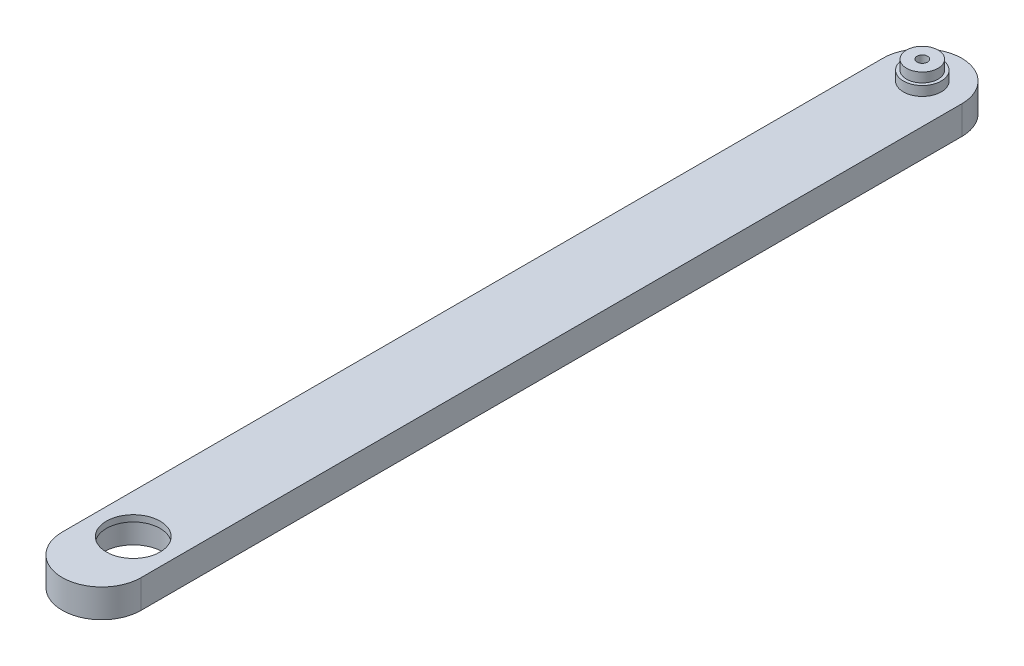
ISO-10303-21;
HEADER;
FILE_DESCRIPTION(('STEP AP214'),'2;1');
FILE_NAME('part.step','',(''),(''),'','','');
FILE_SCHEMA(('AUTOMOTIVE_DESIGN { 1 0 10303 214 1 1 1 1 }'));
ENDSEC;
DATA;
#1=APPLICATION_CONTEXT('core data for automotive mechanical design processes');
#2=APPLICATION_PROTOCOL_DEFINITION('international standard','automotive_design',2000,#1);
#3=PRODUCT_CONTEXT('',#1,'mechanical');
#4=PRODUCT('Part','Part','',(#3));
#5=PRODUCT_RELATED_PRODUCT_CATEGORY('part','',(#4));
#6=PRODUCT_DEFINITION_FORMATION('','',#4);
#7=PRODUCT_DEFINITION_CONTEXT('part definition',#1,'design');
#8=PRODUCT_DEFINITION('design','',#6,#7);
#9=PRODUCT_DEFINITION_SHAPE('','',#8);
#10=(LENGTH_UNIT() NAMED_UNIT(*) SI_UNIT(.MILLI.,.METRE.));
#11=(NAMED_UNIT(*) PLANE_ANGLE_UNIT() SI_UNIT($,.RADIAN.));
#12=(NAMED_UNIT(*) SI_UNIT($,.STERADIAN.) SOLID_ANGLE_UNIT());
#13=UNCERTAINTY_MEASURE_WITH_UNIT(LENGTH_MEASURE(1.E-05),#10,'distance_accuracy_value','');
#14=(GEOMETRIC_REPRESENTATION_CONTEXT(3) GLOBAL_UNCERTAINTY_ASSIGNED_CONTEXT((#13)) GLOBAL_UNIT_ASSIGNED_CONTEXT((#10,
#11,#12)) REPRESENTATION_CONTEXT('',''));
#15=CARTESIAN_POINT('',(0.,0.,0.));
#16=DIRECTION('',(0.,0.,1.));
#17=DIRECTION('',(1.,0.,0.));
#18=AXIS2_PLACEMENT_3D('',#15,#16,#17);
#19=CARTESIAN_POINT('',(0.,-4.5,0.));
#20=DIRECTION('',(0.,1.,0.));
#21=DIRECTION('',(0.,0.,1.));
#22=AXIS2_PLACEMENT_3D('',#19,#20,#21);
#23=CYLINDRICAL_SURFACE('',#22,12.5);
#24=DIRECTION('',(0.,1.,0.));
#25=VECTOR('',#24,1.);
#26=CARTESIAN_POINT('',(-12.5,-4.5,0.));
#27=LINE('',#26,#25);
#28=CARTESIAN_POINT('',(-12.5,-4.5,0.));
#29=VERTEX_POINT('',#28);
#30=CARTESIAN_POINT('',(-12.5,4.5,0.));
#31=VERTEX_POINT('',#30);
#32=EDGE_CURVE('E77',#29,#31,#27,.T.);
#33=ORIENTED_EDGE('',*,*,#32,.T.);
#34=CARTESIAN_POINT('',(0.,4.5,0.));
#35=DIRECTION('',(0.,1.,0.));
#36=DIRECTION('',(0.,0.,1.));
#37=AXIS2_PLACEMENT_3D('',#34,#35,#36);
#38=CIRCLE('',#37,12.5);
#39=CARTESIAN_POINT('',(12.5,4.5,0.));
#40=VERTEX_POINT('',#39);
#41=EDGE_CURVE('E80',#40,#31,#38,.T.);
#42=ORIENTED_EDGE('',*,*,#41,.F.);
#43=DIRECTION('',(0.,1.,0.));
#44=VECTOR('',#43,1.);
#45=CARTESIAN_POINT('',(12.5,-4.5,0.));
#46=LINE('',#45,#44);
#47=CARTESIAN_POINT('',(12.5,-4.5,0.));
#48=VERTEX_POINT('',#47);
#49=EDGE_CURVE('E52',#48,#40,#46,.T.);
#50=ORIENTED_EDGE('',*,*,#49,.F.);
#51=CARTESIAN_POINT('',(0.,-4.5,0.));
#52=DIRECTION('',(0.,1.,0.));
#53=DIRECTION('',(0.,0.,1.));
#54=AXIS2_PLACEMENT_3D('',#51,#52,#53);
#55=CIRCLE('',#54,12.5);
#56=EDGE_CURVE('E81',#48,#29,#55,.T.);
#57=ORIENTED_EDGE('',*,*,#56,.T.);
#58=EDGE_LOOP('',(#33,#42,#50,#57));
#59=FACE_BOUND('',#58,.T.);
#60=ADVANCED_FACE('F36',(#59),#23,.T.);
#61=CARTESIAN_POINT('',(12.5,-4.5,0.));
#62=DIRECTION('',(1.,0.,0.));
#63=DIRECTION('',(0.,0.,-1.));
#64=AXIS2_PLACEMENT_3D('',#61,#62,#63);
#65=PLANE('',#64);
#66=ORIENTED_EDGE('',*,*,#49,.T.);
#67=DIRECTION('',(0.,0.,-1.));
#68=VECTOR('',#67,1.);
#69=CARTESIAN_POINT('',(12.5,4.5,0.));
#70=LINE('',#69,#68);
#71=CARTESIAN_POINT('',(12.5,4.5,260.));
#72=VERTEX_POINT('',#71);
#73=EDGE_CURVE('E98',#72,#40,#70,.T.);
#74=ORIENTED_EDGE('',*,*,#73,.F.);
#75=DIRECTION('',(0.,1.,0.));
#76=VECTOR('',#75,1.);
#77=CARTESIAN_POINT('',(12.5,-4.5,260.));
#78=LINE('',#77,#76);
#79=CARTESIAN_POINT('',(12.5,-4.5,260.));
#80=VERTEX_POINT('',#79);
#81=EDGE_CURVE('E60',#80,#72,#78,.T.);
#82=ORIENTED_EDGE('',*,*,#81,.F.);
#83=DIRECTION('',(0.,0.,-1.));
#84=VECTOR('',#83,1.);
#85=CARTESIAN_POINT('',(12.5,-4.5,0.));
#86=LINE('',#85,#84);
#87=EDGE_CURVE('E86',#80,#48,#86,.T.);
#88=ORIENTED_EDGE('',*,*,#87,.T.);
#89=EDGE_LOOP('',(#66,#74,#82,#88));
#90=FACE_BOUND('',#89,.T.);
#91=ADVANCED_FACE('F149',(#90),#65,.T.);
#92=CARTESIAN_POINT('',(0.,-4.5,260.));
#93=DIRECTION('',(0.,1.,0.));
#94=DIRECTION('',(0.,0.,1.));
#95=AXIS2_PLACEMENT_3D('',#92,#93,#94);
#96=CYLINDRICAL_SURFACE('',#95,12.5);
#97=ORIENTED_EDGE('',*,*,#81,.T.);
#98=CARTESIAN_POINT('',(0.,4.5,260.));
#99=DIRECTION('',(0.,1.,0.));
#100=DIRECTION('',(0.,0.,1.));
#101=AXIS2_PLACEMENT_3D('',#98,#99,#100);
#102=CIRCLE('',#101,12.5);
#103=CARTESIAN_POINT('',(-12.4999999999999,4.5,260.));
#104=VERTEX_POINT('',#103);
#105=EDGE_CURVE('E94',#104,#72,#102,.T.);
#106=ORIENTED_EDGE('',*,*,#105,.F.);
#107=DIRECTION('',(0.,1.,0.));
#108=VECTOR('',#107,1.);
#109=CARTESIAN_POINT('',(-12.4999999999999,-4.5,260.));
#110=LINE('',#109,#108);
#111=CARTESIAN_POINT('',(-12.4999999999999,-4.5,260.));
#112=VERTEX_POINT('',#111);
#113=EDGE_CURVE('E85',#112,#104,#110,.T.);
#114=ORIENTED_EDGE('',*,*,#113,.F.);
#115=CARTESIAN_POINT('',(0.,-4.5,260.));
#116=DIRECTION('',(0.,1.,0.));
#117=DIRECTION('',(0.,0.,1.));
#118=AXIS2_PLACEMENT_3D('',#115,#116,#117);
#119=CIRCLE('',#118,12.5);
#120=EDGE_CURVE('E111',#112,#80,#119,.T.);
#121=ORIENTED_EDGE('',*,*,#120,.T.);
#122=EDGE_LOOP('',(#97,#106,#114,#121));
#123=FACE_BOUND('',#122,.T.);
#124=ADVANCED_FACE('F154',(#123),#96,.T.);
#125=CARTESIAN_POINT('',(-12.5,-4.5,0.));
#126=DIRECTION('',(-1.,0.,0.));
#127=DIRECTION('',(0.,0.,1.));
#128=AXIS2_PLACEMENT_3D('',#125,#126,#127);
#129=PLANE('',#128);
#130=ORIENTED_EDGE('',*,*,#113,.T.);
#131=DIRECTION('',(0.,0.,1.));
#132=VECTOR('',#131,1.);
#133=CARTESIAN_POINT('',(-12.5,4.5,0.));
#134=LINE('',#133,#132);
#135=EDGE_CURVE('E89',#31,#104,#134,.T.);
#136=ORIENTED_EDGE('',*,*,#135,.F.);
#137=ORIENTED_EDGE('',*,*,#32,.F.);
#138=DIRECTION('',(0.,0.,1.));
#139=VECTOR('',#138,1.);
#140=CARTESIAN_POINT('',(-12.5,-4.5,0.));
#141=LINE('',#140,#139);
#142=EDGE_CURVE('E109',#29,#112,#141,.T.);
#143=ORIENTED_EDGE('',*,*,#142,.T.);
#144=EDGE_LOOP('',(#130,#136,#137,#143));
#145=FACE_BOUND('',#144,.T.);
#146=ADVANCED_FACE('F90',(#145),#129,.T.);
#147=CARTESIAN_POINT('',(0.,-4.5,0.));
#148=DIRECTION('',(0.,1.,0.));
#149=DIRECTION('',(0.,0.,1.));
#150=AXIS2_PLACEMENT_3D('',#147,#148,#149);
#151=PLANE('',#150);
#152=CARTESIAN_POINT('',(0.,-4.5,250.));
#153=DIRECTION('',(0.,-1.,0.));
#154=DIRECTION('',(0.,0.,-1.));
#155=AXIS2_PLACEMENT_3D('',#152,#153,#154);
#156=CIRCLE('',#155,9.50000000000001);
#157=CARTESIAN_POINT('',(0.,-4.5,240.5));
#158=VERTEX_POINT('',#157);
#159=EDGE_CURVE('E189',#158,#158,#156,.T.);
#160=ORIENTED_EDGE('',*,*,#159,.F.);
#161=EDGE_LOOP('',(#160));
#162=FACE_BOUND('',#161,.T.);
#163=CARTESIAN_POINT('',(0.,-4.5,0.));
#164=DIRECTION('',(0.,1.,0.));
#165=DIRECTION('',(0.,0.,1.));
#166=AXIS2_PLACEMENT_3D('',#163,#164,#165);
#167=CIRCLE('',#166,6.);
#168=CARTESIAN_POINT('',(0.,-4.5,6.));
#169=VERTEX_POINT('',#168);
#170=EDGE_CURVE('E123',#169,#169,#167,.F.);
#171=ORIENTED_EDGE('',*,*,#170,.F.);
#172=EDGE_LOOP('',(#171));
#173=FACE_BOUND('',#172,.T.);
#174=ORIENTED_EDGE('',*,*,#56,.F.);
#175=ORIENTED_EDGE('',*,*,#87,.F.);
#176=ORIENTED_EDGE('',*,*,#120,.F.);
#177=ORIENTED_EDGE('',*,*,#142,.F.);
#178=EDGE_LOOP('',(#174,#175,#176,#177));
#179=FACE_BOUND('',#178,.T.);
#180=ADVANCED_FACE('F198',(#162,#173,#179),#151,.F.);
#181=CARTESIAN_POINT('',(0.,4.5,0.));
#182=DIRECTION('',(0.,1.,0.));
#183=DIRECTION('',(0.,0.,1.));
#184=AXIS2_PLACEMENT_3D('',#181,#182,#183);
#185=PLANE('',#184);
#186=CARTESIAN_POINT('',(0.,4.5,250.));
#187=DIRECTION('',(0.,1.,0.));
#188=DIRECTION('',(0.,0.,1.));
#189=AXIS2_PLACEMENT_3D('',#186,#187,#188);
#190=CIRCLE('',#189,8.50000000000001);
#191=CARTESIAN_POINT('',(0.,4.5,258.5));
#192=VERTEX_POINT('',#191);
#193=EDGE_CURVE('E40',#192,#192,#190,.T.);
#194=ORIENTED_EDGE('',*,*,#193,.F.);
#195=EDGE_LOOP('',(#194));
#196=FACE_BOUND('',#195,.T.);
#197=CARTESIAN_POINT('',(0.,4.5,0.));
#198=DIRECTION('',(0.,1.,0.));
#199=DIRECTION('',(0.,0.,1.));
#200=AXIS2_PLACEMENT_3D('',#197,#198,#199);
#201=CIRCLE('',#200,6.);
#202=CARTESIAN_POINT('',(0.,4.5,6.));
#203=VERTEX_POINT('',#202);
#204=EDGE_CURVE('E188',#203,#203,#201,.T.);
#205=ORIENTED_EDGE('',*,*,#204,.F.);
#206=EDGE_LOOP('',(#205));
#207=FACE_BOUND('',#206,.T.);
#208=ORIENTED_EDGE('',*,*,#41,.T.);
#209=ORIENTED_EDGE('',*,*,#135,.T.);
#210=ORIENTED_EDGE('',*,*,#105,.T.);
#211=ORIENTED_EDGE('',*,*,#73,.T.);
#212=EDGE_LOOP('',(#208,#209,#210,#211));
#213=FACE_BOUND('',#212,.T.);
#214=ADVANCED_FACE('F97',(#196,#207,#213),#185,.T.);
#215=CARTESIAN_POINT('',(0.,-7.5,0.));
#216=DIRECTION('',(0.,1.,0.));
#217=DIRECTION('',(0.,0.,1.));
#218=AXIS2_PLACEMENT_3D('',#215,#216,#217);
#219=CYLINDRICAL_SURFACE('',#218,6.);
#220=CARTESIAN_POINT('',(0.,-7.5,0.));
#221=DIRECTION('',(0.,-1.,0.));
#222=DIRECTION('',(0.,0.,-1.));
#223=AXIS2_PLACEMENT_3D('',#220,#221,#222);
#224=CIRCLE('',#223,6.);
#225=CARTESIAN_POINT('',(0.,-7.5,-6.));
#226=VERTEX_POINT('',#225);
#227=EDGE_CURVE('E99',#226,#226,#224,.T.);
#228=ORIENTED_EDGE('',*,*,#227,.F.);
#229=EDGE_LOOP('',(#228));
#230=FACE_BOUND('',#229,.T.);
#231=ORIENTED_EDGE('',*,*,#170,.T.);
#232=EDGE_LOOP('',(#231));
#233=FACE_BOUND('',#232,.T.);
#234=ADVANCED_FACE('F144',(#230,#233),#219,.T.);
#235=CARTESIAN_POINT('',(0.,-7.5,0.));
#236=DIRECTION('',(0.,-1.,0.));
#237=DIRECTION('',(0.,0.,-1.));
#238=AXIS2_PLACEMENT_3D('',#235,#236,#237);
#239=PLANE('',#238);
#240=CARTESIAN_POINT('',(0.,-7.5,0.));
#241=DIRECTION('',(0.,-1.,0.));
#242=DIRECTION('',(0.,0.,-1.));
#243=AXIS2_PLACEMENT_3D('',#240,#241,#242);
#244=CIRCLE('',#243,5.);
#245=CARTESIAN_POINT('',(0.,-7.5,-5.));
#246=VERTEX_POINT('',#245);
#247=EDGE_CURVE('E45',#246,#246,#244,.F.);
#248=ORIENTED_EDGE('',*,*,#247,.T.);
#249=EDGE_LOOP('',(#248));
#250=FACE_BOUND('',#249,.T.);
#251=ORIENTED_EDGE('',*,*,#227,.T.);
#252=EDGE_LOOP('',(#251));
#253=FACE_BOUND('',#252,.T.);
#254=ADVANCED_FACE('F129',(#250,#253),#239,.T.);
#255=CARTESIAN_POINT('',(0.,-10.5,0.));
#256=DIRECTION('',(0.,1.,0.));
#257=DIRECTION('',(0.,0.,1.));
#258=AXIS2_PLACEMENT_3D('',#255,#256,#257);
#259=PLANE('',#258);
#260=CARTESIAN_POINT('',(0.,-10.5,0.));
#261=DIRECTION('',(0.,-1.,0.));
#262=DIRECTION('',(0.,0.,-1.));
#263=AXIS2_PLACEMENT_3D('',#260,#261,#262);
#264=CIRCLE('',#263,1.65);
#265=CARTESIAN_POINT('',(0.,-10.5,-1.65));
#266=VERTEX_POINT('',#265);
#267=EDGE_CURVE('E178',#266,#266,#264,.T.);
#268=ORIENTED_EDGE('',*,*,#267,.F.);
#269=EDGE_LOOP('',(#268));
#270=FACE_BOUND('',#269,.T.);
#271=CARTESIAN_POINT('',(0.,-10.5,0.));
#272=DIRECTION('',(0.,1.,0.));
#273=DIRECTION('',(0.,0.,1.));
#274=AXIS2_PLACEMENT_3D('',#271,#272,#273);
#275=CIRCLE('',#274,5.);
#276=CARTESIAN_POINT('',(0.,-10.5,5.));
#277=VERTEX_POINT('',#276);
#278=EDGE_CURVE('E120',#277,#277,#275,.T.);
#279=ORIENTED_EDGE('',*,*,#278,.F.);
#280=EDGE_LOOP('',(#279));
#281=FACE_BOUND('',#280,.T.);
#282=ADVANCED_FACE('F136',(#270,#281),#259,.F.);
#283=CARTESIAN_POINT('',(0.,-10.5,0.));
#284=DIRECTION('',(0.,1.,0.));
#285=DIRECTION('',(0.,0.,1.));
#286=AXIS2_PLACEMENT_3D('',#283,#284,#285);
#287=CYLINDRICAL_SURFACE('',#286,5.);
#288=ORIENTED_EDGE('',*,*,#247,.F.);
#289=EDGE_LOOP('',(#288));
#290=FACE_BOUND('',#289,.T.);
#291=ORIENTED_EDGE('',*,*,#278,.T.);
#292=EDGE_LOOP('',(#291));
#293=FACE_BOUND('',#292,.T.);
#294=ADVANCED_FACE('F132',(#290,#293),#287,.T.);
#295=CARTESIAN_POINT('',(0.,7.5,0.));
#296=DIRECTION('',(0.,-1.,0.));
#297=DIRECTION('',(0.,0.,-1.));
#298=AXIS2_PLACEMENT_3D('',#295,#296,#297);
#299=CYLINDRICAL_SURFACE('',#298,6.);
#300=CARTESIAN_POINT('',(0.,7.5,0.));
#301=DIRECTION('',(0.,1.,0.));
#302=DIRECTION('',(0.,0.,1.));
#303=AXIS2_PLACEMENT_3D('',#300,#301,#302);
#304=CIRCLE('',#303,6.);
#305=CARTESIAN_POINT('',(0.,7.5,6.));
#306=VERTEX_POINT('',#305);
#307=EDGE_CURVE('E102',#306,#306,#304,.T.);
#308=ORIENTED_EDGE('',*,*,#307,.F.);
#309=EDGE_LOOP('',(#308));
#310=FACE_BOUND('',#309,.T.);
#311=ORIENTED_EDGE('',*,*,#204,.T.);
#312=EDGE_LOOP('',(#311));
#313=FACE_BOUND('',#312,.T.);
#314=ADVANCED_FACE('F135',(#310,#313),#299,.T.);
#315=CARTESIAN_POINT('',(0.,7.5,0.));
#316=DIRECTION('',(0.,1.,0.));
#317=DIRECTION('',(0.,0.,1.));
#318=AXIS2_PLACEMENT_3D('',#315,#316,#317);
#319=PLANE('',#318);
#320=CARTESIAN_POINT('',(0.,7.5,0.));
#321=DIRECTION('',(0.,1.,0.));
#322=DIRECTION('',(0.,0.,1.));
#323=AXIS2_PLACEMENT_3D('',#320,#321,#322);
#324=CIRCLE('',#323,5.);
#325=CARTESIAN_POINT('',(0.,7.5,5.));
#326=VERTEX_POINT('',#325);
#327=EDGE_CURVE('E11',#326,#326,#324,.F.);
#328=ORIENTED_EDGE('',*,*,#327,.T.);
#329=EDGE_LOOP('',(#328));
#330=FACE_BOUND('',#329,.T.);
#331=ORIENTED_EDGE('',*,*,#307,.T.);
#332=EDGE_LOOP('',(#331));
#333=FACE_BOUND('',#332,.T.);
#334=ADVANCED_FACE('F160',(#330,#333),#319,.T.);
#335=CARTESIAN_POINT('',(0.,10.5,0.));
#336=DIRECTION('',(0.,1.,0.));
#337=DIRECTION('',(0.,0.,1.));
#338=AXIS2_PLACEMENT_3D('',#335,#336,#337);
#339=PLANE('',#338);
#340=CARTESIAN_POINT('',(0.,10.5,0.));
#341=DIRECTION('',(0.,-1.,0.));
#342=DIRECTION('',(0.,0.,-1.));
#343=AXIS2_PLACEMENT_3D('',#340,#341,#342);
#344=CIRCLE('',#343,1.64999999999999);
#345=CARTESIAN_POINT('',(0.,10.5,-1.64999999999999));
#346=VERTEX_POINT('',#345);
#347=EDGE_CURVE('E173',#346,#346,#344,.T.);
#348=ORIENTED_EDGE('',*,*,#347,.T.);
#349=EDGE_LOOP('',(#348));
#350=FACE_BOUND('',#349,.T.);
#351=CARTESIAN_POINT('',(0.,10.5,0.));
#352=DIRECTION('',(0.,1.,0.));
#353=DIRECTION('',(0.,0.,1.));
#354=AXIS2_PLACEMENT_3D('',#351,#352,#353);
#355=CIRCLE('',#354,5.);
#356=CARTESIAN_POINT('',(0.,10.5,5.));
#357=VERTEX_POINT('',#356);
#358=EDGE_CURVE('E115',#357,#357,#355,.T.);
#359=ORIENTED_EDGE('',*,*,#358,.T.);
#360=EDGE_LOOP('',(#359));
#361=FACE_BOUND('',#360,.T.);
#362=ADVANCED_FACE('F158',(#350,#361),#339,.T.);
#363=ORIENTED_EDGE('',*,*,#327,.F.);
#364=EDGE_LOOP('',(#363));
#365=FACE_BOUND('',#364,.T.);
#366=ORIENTED_EDGE('',*,*,#358,.F.);
#367=EDGE_LOOP('',(#366));
#368=FACE_BOUND('',#367,.T.);
#369=ADVANCED_FACE('F38',(#365,#368),#287,.T.);
#370=CARTESIAN_POINT('',(0.,2.5,250.));
#371=DIRECTION('',(0.,-1.,0.));
#372=DIRECTION('',(0.,0.,-1.));
#373=AXIS2_PLACEMENT_3D('',#370,#371,#372);
#374=CYLINDRICAL_SURFACE('',#373,9.50000000000001);
#375=CARTESIAN_POINT('',(0.,2.5,250.));
#376=DIRECTION('',(0.,-1.,0.));
#377=DIRECTION('',(0.,0.,-1.));
#378=AXIS2_PLACEMENT_3D('',#375,#376,#377);
#379=CIRCLE('',#378,9.50000000000001);
#380=CARTESIAN_POINT('',(0.,2.5,240.5));
#381=VERTEX_POINT('',#380);
#382=EDGE_CURVE('E185',#381,#381,#379,.T.);
#383=ORIENTED_EDGE('',*,*,#382,.F.);
#384=EDGE_LOOP('',(#383));
#385=FACE_BOUND('',#384,.T.);
#386=ORIENTED_EDGE('',*,*,#159,.T.);
#387=EDGE_LOOP('',(#386));
#388=FACE_BOUND('',#387,.T.);
#389=ADVANCED_FACE('F166',(#385,#388),#374,.F.);
#390=CARTESIAN_POINT('',(0.,2.5,250.));
#391=DIRECTION('',(0.,-1.,0.));
#392=DIRECTION('',(0.,0.,-1.));
#393=AXIS2_PLACEMENT_3D('',#390,#391,#392);
#394=PLANE('',#393);
#395=CARTESIAN_POINT('',(0.,2.5,250.));
#396=DIRECTION('',(0.,-1.,0.));
#397=DIRECTION('',(0.,0.,-1.));
#398=AXIS2_PLACEMENT_3D('',#395,#396,#397);
#399=CIRCLE('',#398,8.50000000000001);
#400=CARTESIAN_POINT('',(0.,2.5,241.5));
#401=VERTEX_POINT('',#400);
#402=EDGE_CURVE('E177',#401,#401,#399,.T.);
#403=ORIENTED_EDGE('',*,*,#402,.F.);
#404=EDGE_LOOP('',(#403));
#405=FACE_BOUND('',#404,.T.);
#406=ORIENTED_EDGE('',*,*,#382,.T.);
#407=EDGE_LOOP('',(#406));
#408=FACE_BOUND('',#407,.T.);
#409=ADVANCED_FACE('F238',(#405,#408),#394,.T.);
#410=CARTESIAN_POINT('',(0.,10.5,250.));
#411=DIRECTION('',(0.,-1.,0.));
#412=DIRECTION('',(0.,0.,-1.));
#413=AXIS2_PLACEMENT_3D('',#410,#411,#412);
#414=CYLINDRICAL_SURFACE('',#413,8.50000000000001);
#415=ORIENTED_EDGE('',*,*,#193,.T.);
#416=EDGE_LOOP('',(#415));
#417=FACE_BOUND('',#416,.T.);
#418=ORIENTED_EDGE('',*,*,#402,.T.);
#419=EDGE_LOOP('',(#418));
#420=FACE_BOUND('',#419,.T.);
#421=ADVANCED_FACE('F254',(#417,#420),#414,.F.);
#422=CARTESIAN_POINT('',(0.,-10.5,0.));
#423=DIRECTION('',(0.,-1.,0.));
#424=DIRECTION('',(0.,0.,-1.));
#425=AXIS2_PLACEMENT_3D('',#422,#423,#424);
#426=CYLINDRICAL_SURFACE('',#425,1.65);
#427=ORIENTED_EDGE('',*,*,#347,.F.);
#428=EDGE_LOOP('',(#427));
#429=FACE_BOUND('',#428,.T.);
#430=ORIENTED_EDGE('',*,*,#267,.T.);
#431=EDGE_LOOP('',(#430));
#432=FACE_BOUND('',#431,.T.);
#433=ADVANCED_FACE('F263',(#429,#432),#426,.F.);
#434=CLOSED_SHELL('',(#60,#91,#124,#146,#180,#214,#234,#254,#282,#294,#314,#334,#362,#369,#389,
#409,#421,#433));
#435=MANIFOLD_SOLID_BREP('B2',#434);
#436=ADVANCED_BREP_SHAPE_REPRESENTATION('',(#18,#435),#14);
#437=SHAPE_DEFINITION_REPRESENTATION(#9,#436);
ENDSEC;
END-ISO-10303-21;
